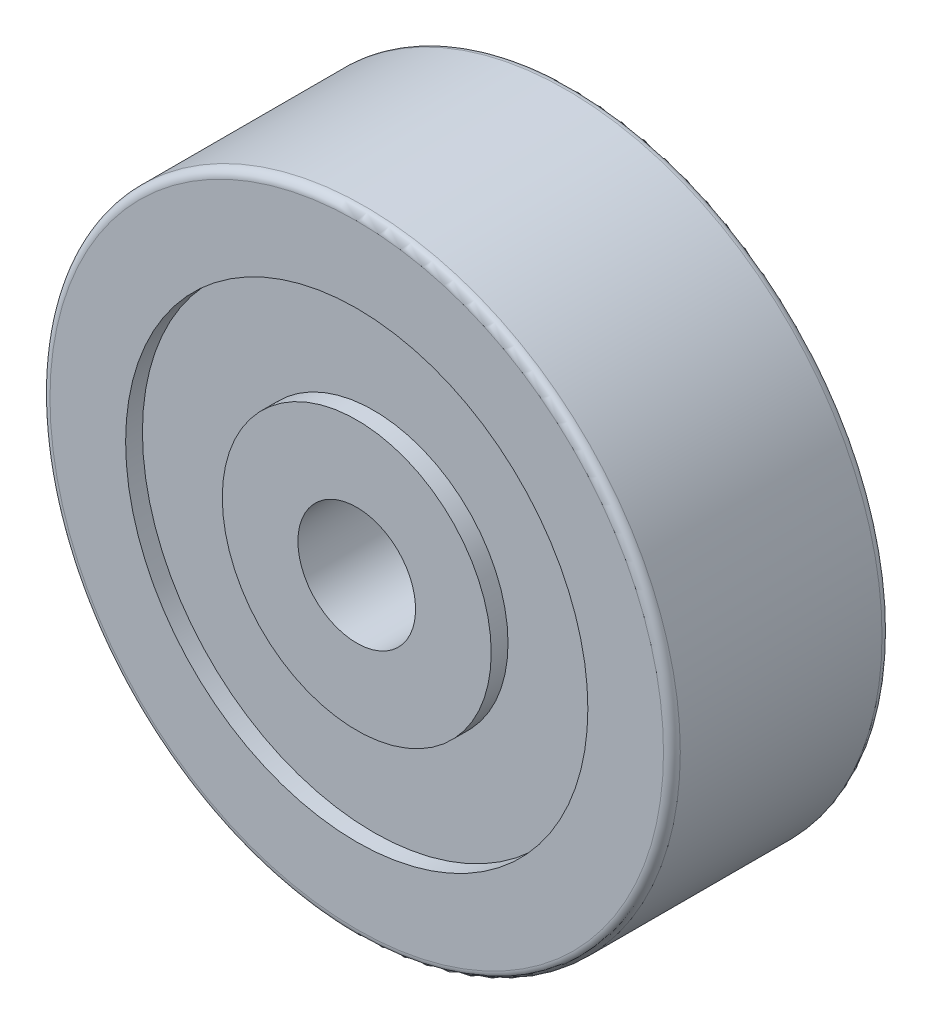
ISO-10303-21;
HEADER;
FILE_DESCRIPTION(('STEP AP214'),'2;1');
FILE_NAME('part.step','',(''),(''),'','','');
FILE_SCHEMA(('AUTOMOTIVE_DESIGN { 1 0 10303 214 1 1 1 1 }'));
ENDSEC;
DATA;
#1=APPLICATION_CONTEXT('core data for automotive mechanical design processes');
#2=APPLICATION_PROTOCOL_DEFINITION('international standard','automotive_design',2000,#1);
#3=PRODUCT_CONTEXT('',#1,'mechanical');
#4=PRODUCT('Part','Part','',(#3));
#5=PRODUCT_RELATED_PRODUCT_CATEGORY('part','',(#4));
#6=PRODUCT_DEFINITION_FORMATION('','',#4);
#7=PRODUCT_DEFINITION_CONTEXT('part definition',#1,'design');
#8=PRODUCT_DEFINITION('design','',#6,#7);
#9=PRODUCT_DEFINITION_SHAPE('','',#8);
#10=(LENGTH_UNIT() NAMED_UNIT(*) SI_UNIT(.MILLI.,.METRE.));
#11=(NAMED_UNIT(*) PLANE_ANGLE_UNIT() SI_UNIT($,.RADIAN.));
#12=(NAMED_UNIT(*) SI_UNIT($,.STERADIAN.) SOLID_ANGLE_UNIT());
#13=UNCERTAINTY_MEASURE_WITH_UNIT(LENGTH_MEASURE(1.E-05),#10,'distance_accuracy_value','');
#14=(GEOMETRIC_REPRESENTATION_CONTEXT(3) GLOBAL_UNCERTAINTY_ASSIGNED_CONTEXT((#13)) GLOBAL_UNIT_ASSIGNED_CONTEXT((#10,
#11,#12)) REPRESENTATION_CONTEXT('',''));
#15=CARTESIAN_POINT('',(0.,0.,0.));
#16=DIRECTION('',(0.,0.,1.));
#17=DIRECTION('',(1.,0.,0.));
#18=AXIS2_PLACEMENT_3D('',#15,#16,#17);
#19=CARTESIAN_POINT('',(0.,0.,-13.));
#20=DIRECTION('',(0.,0.,1.));
#21=DIRECTION('',(1.,0.,0.));
#22=AXIS2_PLACEMENT_3D('',#19,#20,#21);
#23=CYLINDRICAL_SURFACE('',#22,37.5);
#24=CARTESIAN_POINT('',(0.,0.,12.));
#25=DIRECTION('',(0.,0.,1.));
#26=DIRECTION('',(1.,0.,0.));
#27=AXIS2_PLACEMENT_3D('',#24,#25,#26);
#28=CIRCLE('',#27,37.5);
#29=CARTESIAN_POINT('',(37.5,0.,12.));
#30=VERTEX_POINT('',#29);
#31=EDGE_CURVE('E10',#30,#30,#28,.F.);
#32=ORIENTED_EDGE('',*,*,#31,.T.);
#33=EDGE_LOOP('',(#32));
#34=FACE_BOUND('',#33,.T.);
#35=CARTESIAN_POINT('',(0.,0.,-12.));
#36=DIRECTION('',(0.,0.,1.));
#37=DIRECTION('',(1.,0.,0.));
#38=AXIS2_PLACEMENT_3D('',#35,#36,#37);
#39=CIRCLE('',#38,37.5);
#40=CARTESIAN_POINT('',(37.5,0.,-12.));
#41=VERTEX_POINT('',#40);
#42=EDGE_CURVE('E47',#41,#41,#39,.T.);
#43=ORIENTED_EDGE('',*,*,#42,.T.);
#44=EDGE_LOOP('',(#43));
#45=FACE_BOUND('',#44,.T.);
#46=ADVANCED_FACE('F39',(#34,#45),#23,.T.);
#47=CARTESIAN_POINT('',(0.,0.,-13.));
#48=DIRECTION('',(0.,0.,1.));
#49=DIRECTION('',(1.,0.,0.));
#50=AXIS2_PLACEMENT_3D('',#47,#48,#49);
#51=PLANE('',#50);
#52=CARTESIAN_POINT('',(0.,0.,-13.));
#53=DIRECTION('',(0.,0.,1.));
#54=DIRECTION('',(1.,0.,0.));
#55=AXIS2_PLACEMENT_3D('',#52,#53,#54);
#56=CIRCLE('',#55,28.5);
#57=CARTESIAN_POINT('',(28.5,0.,-13.));
#58=VERTEX_POINT('',#57);
#59=EDGE_CURVE('E57',#58,#58,#56,.T.);
#60=ORIENTED_EDGE('',*,*,#59,.T.);
#61=EDGE_LOOP('',(#60));
#62=FACE_BOUND('',#61,.T.);
#63=CARTESIAN_POINT('',(0.,0.,-13.));
#64=DIRECTION('',(0.,0.,1.));
#65=DIRECTION('',(1.,0.,0.));
#66=AXIS2_PLACEMENT_3D('',#63,#64,#65);
#67=CIRCLE('',#66,36.5);
#68=CARTESIAN_POINT('',(36.5,0.,-13.));
#69=VERTEX_POINT('',#68);
#70=EDGE_CURVE('E63',#69,#69,#67,.F.);
#71=ORIENTED_EDGE('',*,*,#70,.T.);
#72=EDGE_LOOP('',(#71));
#73=FACE_BOUND('',#72,.T.);
#74=ADVANCED_FACE('F138',(#62,#73),#51,.F.);
#75=CARTESIAN_POINT('',(0.,0.,13.));
#76=DIRECTION('',(0.,0.,1.));
#77=DIRECTION('',(1.,0.,0.));
#78=AXIS2_PLACEMENT_3D('',#75,#76,#77);
#79=PLANE('',#78);
#80=CARTESIAN_POINT('',(0.,0.,13.));
#81=DIRECTION('',(0.,0.,1.));
#82=DIRECTION('',(1.,0.,0.));
#83=AXIS2_PLACEMENT_3D('',#80,#81,#82);
#84=CIRCLE('',#83,36.5);
#85=CARTESIAN_POINT('',(36.5,0.,13.));
#86=VERTEX_POINT('',#85);
#87=EDGE_CURVE('E52',#86,#86,#84,.T.);
#88=ORIENTED_EDGE('',*,*,#87,.T.);
#89=EDGE_LOOP('',(#88));
#90=FACE_BOUND('',#89,.T.);
#91=CARTESIAN_POINT('',(0.,0.,13.));
#92=DIRECTION('',(0.,0.,-1.));
#93=DIRECTION('',(-1.,0.,0.));
#94=AXIS2_PLACEMENT_3D('',#91,#92,#93);
#95=CIRCLE('',#94,27.5);
#96=CARTESIAN_POINT('',(-27.5,0.,13.));
#97=VERTEX_POINT('',#96);
#98=EDGE_CURVE('E88',#97,#97,#95,.T.);
#99=ORIENTED_EDGE('',*,*,#98,.T.);
#100=EDGE_LOOP('',(#99));
#101=FACE_BOUND('',#100,.T.);
#102=ADVANCED_FACE('F143',(#90,#101),#79,.T.);
#103=CARTESIAN_POINT('',(0.,0.,-11.));
#104=DIRECTION('',(0.,0.,-1.));
#105=DIRECTION('',(-1.,0.,0.));
#106=AXIS2_PLACEMENT_3D('',#103,#104,#105);
#107=CYLINDRICAL_SURFACE('',#106,27.5);
#108=CARTESIAN_POINT('',(0.,0.,-12.));
#109=DIRECTION('',(0.,0.,1.));
#110=DIRECTION('',(1.,0.,0.));
#111=AXIS2_PLACEMENT_3D('',#108,#109,#110);
#112=CIRCLE('',#111,27.5);
#113=CARTESIAN_POINT('',(27.5,0.,-12.));
#114=VERTEX_POINT('',#113);
#115=EDGE_CURVE('E67',#114,#114,#112,.F.);
#116=ORIENTED_EDGE('',*,*,#115,.T.);
#117=EDGE_LOOP('',(#116));
#118=FACE_BOUND('',#117,.T.);
#119=CARTESIAN_POINT('',(0.,0.,-11.));
#120=DIRECTION('',(0.,0.,-1.));
#121=DIRECTION('',(-1.,0.,0.));
#122=AXIS2_PLACEMENT_3D('',#119,#120,#121);
#123=CIRCLE('',#122,27.5);
#124=CARTESIAN_POINT('',(-27.5,0.,-11.));
#125=VERTEX_POINT('',#124);
#126=EDGE_CURVE('E83',#125,#125,#123,.T.);
#127=ORIENTED_EDGE('',*,*,#126,.F.);
#128=EDGE_LOOP('',(#127));
#129=FACE_BOUND('',#128,.T.);
#130=ADVANCED_FACE('F166',(#118,#129),#107,.F.);
#131=CARTESIAN_POINT('',(0.,0.,-11.));
#132=DIRECTION('',(0.,0.,-1.));
#133=DIRECTION('',(-1.,0.,0.));
#134=AXIS2_PLACEMENT_3D('',#131,#132,#133);
#135=PLANE('',#134);
#136=CARTESIAN_POINT('',(0.,0.,-11.));
#137=DIRECTION('',(0.,0.,-1.));
#138=DIRECTION('',(-1.,0.,0.));
#139=AXIS2_PLACEMENT_3D('',#136,#137,#138);
#140=CIRCLE('',#139,16.);
#141=CARTESIAN_POINT('',(-16.,0.,-11.));
#142=VERTEX_POINT('',#141);
#143=EDGE_CURVE('E92',#142,#142,#140,.T.);
#144=ORIENTED_EDGE('',*,*,#143,.F.);
#145=EDGE_LOOP('',(#144));
#146=FACE_BOUND('',#145,.T.);
#147=ORIENTED_EDGE('',*,*,#126,.T.);
#148=EDGE_LOOP('',(#147));
#149=FACE_BOUND('',#148,.T.);
#150=ADVANCED_FACE('F171',(#146,#149),#135,.T.);
#151=CARTESIAN_POINT('',(0.,0.,11.));
#152=DIRECTION('',(0.,0.,1.));
#153=DIRECTION('',(1.,0.,0.));
#154=AXIS2_PLACEMENT_3D('',#151,#152,#153);
#155=CYLINDRICAL_SURFACE('',#154,27.5);
#156=CARTESIAN_POINT('',(0.,0.,11.));
#157=DIRECTION('',(0.,0.,-1.));
#158=DIRECTION('',(-1.,0.,0.));
#159=AXIS2_PLACEMENT_3D('',#156,#157,#158);
#160=CIRCLE('',#159,27.5);
#161=CARTESIAN_POINT('',(-27.5,0.,11.));
#162=VERTEX_POINT('',#161);
#163=EDGE_CURVE('E87',#162,#162,#160,.T.);
#164=ORIENTED_EDGE('',*,*,#163,.T.);
#165=EDGE_LOOP('',(#164));
#166=FACE_BOUND('',#165,.T.);
#167=ORIENTED_EDGE('',*,*,#98,.F.);
#168=EDGE_LOOP('',(#167));
#169=FACE_BOUND('',#168,.T.);
#170=ADVANCED_FACE('F169',(#166,#169),#155,.F.);
#171=CARTESIAN_POINT('',(0.,0.,11.));
#172=DIRECTION('',(0.,0.,1.));
#173=DIRECTION('',(-1.,0.,0.));
#174=AXIS2_PLACEMENT_3D('',#171,#172,#173);
#175=PLANE('',#174);
#176=CARTESIAN_POINT('',(0.,0.,11.));
#177=DIRECTION('',(0.,0.,1.));
#178=DIRECTION('',(1.,0.,0.));
#179=AXIS2_PLACEMENT_3D('',#176,#177,#178);
#180=CIRCLE('',#179,16.);
#181=CARTESIAN_POINT('',(16.,0.,11.));
#182=VERTEX_POINT('',#181);
#183=EDGE_CURVE('E79',#182,#182,#180,.T.);
#184=ORIENTED_EDGE('',*,*,#183,.F.);
#185=EDGE_LOOP('',(#184));
#186=FACE_BOUND('',#185,.T.);
#187=ORIENTED_EDGE('',*,*,#163,.F.);
#188=EDGE_LOOP('',(#187));
#189=FACE_BOUND('',#188,.T.);
#190=ADVANCED_FACE('F134',(#186,#189),#175,.T.);
#191=CARTESIAN_POINT('',(0.,0.,-13.));
#192=DIRECTION('',(0.,0.,1.));
#193=DIRECTION('',(1.,0.,0.));
#194=AXIS2_PLACEMENT_3D('',#191,#192,#193);
#195=CYLINDRICAL_SURFACE('',#194,16.);
#196=CARTESIAN_POINT('',(0.,0.,-12.));
#197=DIRECTION('',(0.,0.,-1.));
#198=DIRECTION('',(-1.,0.,0.));
#199=AXIS2_PLACEMENT_3D('',#196,#197,#198);
#200=CIRCLE('',#199,16.);
#201=CARTESIAN_POINT('',(-16.,0.,-12.));
#202=VERTEX_POINT('',#201);
#203=EDGE_CURVE('E71',#202,#202,#200,.F.);
#204=ORIENTED_EDGE('',*,*,#203,.T.);
#205=EDGE_LOOP('',(#204));
#206=FACE_BOUND('',#205,.T.);
#207=ORIENTED_EDGE('',*,*,#143,.T.);
#208=EDGE_LOOP('',(#207));
#209=FACE_BOUND('',#208,.T.);
#210=ADVANCED_FACE('F125',(#206,#209),#195,.T.);
#211=CARTESIAN_POINT('',(0.,0.,-13.));
#212=DIRECTION('',(0.,0.,-1.));
#213=DIRECTION('',(-1.,0.,0.));
#214=AXIS2_PLACEMENT_3D('',#211,#212,#213);
#215=PLANE('',#214);
#216=CARTESIAN_POINT('',(0.,0.,-13.));
#217=DIRECTION('',(0.,0.,-1.));
#218=DIRECTION('',(-1.,0.,0.));
#219=AXIS2_PLACEMENT_3D('',#216,#217,#218);
#220=CIRCLE('',#219,15.);
#221=CARTESIAN_POINT('',(-15.,0.,-13.));
#222=VERTEX_POINT('',#221);
#223=EDGE_CURVE('E75',#222,#222,#220,.T.);
#224=ORIENTED_EDGE('',*,*,#223,.T.);
#225=EDGE_LOOP('',(#224));
#226=FACE_BOUND('',#225,.T.);
#227=CARTESIAN_POINT('',(0.,0.,-13.));
#228=DIRECTION('',(0.,0.,-1.));
#229=DIRECTION('',(-1.,0.,0.));
#230=AXIS2_PLACEMENT_3D('',#227,#228,#229);
#231=CIRCLE('',#230,7.);
#232=CARTESIAN_POINT('',(-7.,0.,-13.));
#233=VERTEX_POINT('',#232);
#234=EDGE_CURVE('E104',#233,#233,#231,.T.);
#235=ORIENTED_EDGE('',*,*,#234,.F.);
#236=EDGE_LOOP('',(#235));
#237=FACE_BOUND('',#236,.T.);
#238=ADVANCED_FACE('F122',(#226,#237),#215,.T.);
#239=CARTESIAN_POINT('',(0.,0.,13.));
#240=DIRECTION('',(0.,0.,-1.));
#241=DIRECTION('',(-1.,0.,0.));
#242=AXIS2_PLACEMENT_3D('',#239,#240,#241);
#243=CYLINDRICAL_SURFACE('',#242,16.);
#244=CARTESIAN_POINT('',(0.,0.,13.));
#245=DIRECTION('',(0.,0.,-1.));
#246=DIRECTION('',(-1.,0.,0.));
#247=AXIS2_PLACEMENT_3D('',#244,#245,#246);
#248=CIRCLE('',#247,16.);
#249=CARTESIAN_POINT('',(-16.,0.,13.));
#250=VERTEX_POINT('',#249);
#251=EDGE_CURVE('E99',#250,#250,#248,.T.);
#252=ORIENTED_EDGE('',*,*,#251,.T.);
#253=EDGE_LOOP('',(#252));
#254=FACE_BOUND('',#253,.T.);
#255=ORIENTED_EDGE('',*,*,#183,.T.);
#256=EDGE_LOOP('',(#255));
#257=FACE_BOUND('',#256,.T.);
#258=ADVANCED_FACE('F124',(#254,#257),#243,.T.);
#259=CARTESIAN_POINT('',(0.,0.,13.));
#260=DIRECTION('',(0.,0.,1.));
#261=DIRECTION('',(-1.,0.,0.));
#262=AXIS2_PLACEMENT_3D('',#259,#260,#261);
#263=PLANE('',#262);
#264=CARTESIAN_POINT('',(0.,0.,13.));
#265=DIRECTION('',(0.,0.,-1.));
#266=DIRECTION('',(-1.,0.,0.));
#267=AXIS2_PLACEMENT_3D('',#264,#265,#266);
#268=CIRCLE('',#267,7.);
#269=CARTESIAN_POINT('',(-7.,0.,13.));
#270=VERTEX_POINT('',#269);
#271=EDGE_CURVE('E103',#270,#270,#268,.T.);
#272=ORIENTED_EDGE('',*,*,#271,.T.);
#273=EDGE_LOOP('',(#272));
#274=FACE_BOUND('',#273,.T.);
#275=ORIENTED_EDGE('',*,*,#251,.F.);
#276=EDGE_LOOP('',(#275));
#277=FACE_BOUND('',#276,.T.);
#278=ADVANCED_FACE('F112',(#274,#277),#263,.T.);
#279=CARTESIAN_POINT('',(0.,0.,13.));
#280=DIRECTION('',(0.,0.,-1.));
#281=DIRECTION('',(-1.,0.,0.));
#282=AXIS2_PLACEMENT_3D('',#279,#280,#281);
#283=CYLINDRICAL_SURFACE('',#282,7.);
#284=ORIENTED_EDGE('',*,*,#271,.F.);
#285=EDGE_LOOP('',(#284));
#286=FACE_BOUND('',#285,.T.);
#287=ORIENTED_EDGE('',*,*,#234,.T.);
#288=EDGE_LOOP('',(#287));
#289=FACE_BOUND('',#288,.T.);
#290=ADVANCED_FACE('F115',(#286,#289),#283,.F.);
#291=CARTESIAN_POINT('',(0.,0.,-12.));
#292=DIRECTION('',(0.,0.,-1.));
#293=DIRECTION('',(-1.,0.,0.));
#294=AXIS2_PLACEMENT_3D('',#291,#292,#293);
#295=TOROIDAL_SURFACE('',#294,15.,1.);
#296=ORIENTED_EDGE('',*,*,#203,.F.);
#297=EDGE_LOOP('',(#296));
#298=FACE_BOUND('',#297,.T.);
#299=ORIENTED_EDGE('',*,*,#223,.F.);
#300=EDGE_LOOP('',(#299));
#301=FACE_BOUND('',#300,.T.);
#302=ADVANCED_FACE('F118',(#298,#301),#295,.T.);
#303=CARTESIAN_POINT('',(0.,0.,-12.));
#304=DIRECTION('',(0.,0.,1.));
#305=DIRECTION('',(1.,0.,0.));
#306=AXIS2_PLACEMENT_3D('',#303,#304,#305);
#307=TOROIDAL_SURFACE('',#306,28.5,1.);
#308=ORIENTED_EDGE('',*,*,#59,.F.);
#309=EDGE_LOOP('',(#308));
#310=FACE_BOUND('',#309,.T.);
#311=ORIENTED_EDGE('',*,*,#115,.F.);
#312=EDGE_LOOP('',(#311));
#313=FACE_BOUND('',#312,.T.);
#314=ADVANCED_FACE('F150',(#310,#313),#307,.T.);
#315=CARTESIAN_POINT('',(0.,0.,12.));
#316=DIRECTION('',(0.,0.,1.));
#317=DIRECTION('',(1.,0.,0.));
#318=AXIS2_PLACEMENT_3D('',#315,#316,#317);
#319=TOROIDAL_SURFACE('',#318,36.5,1.);
#320=ORIENTED_EDGE('',*,*,#31,.F.);
#321=EDGE_LOOP('',(#320));
#322=FACE_BOUND('',#321,.T.);
#323=ORIENTED_EDGE('',*,*,#87,.F.);
#324=EDGE_LOOP('',(#323));
#325=FACE_BOUND('',#324,.T.);
#326=ADVANCED_FACE('F153',(#322,#325),#319,.T.);
#327=CARTESIAN_POINT('',(0.,0.,-12.));
#328=DIRECTION('',(0.,0.,1.));
#329=DIRECTION('',(1.,0.,0.));
#330=AXIS2_PLACEMENT_3D('',#327,#328,#329);
#331=TOROIDAL_SURFACE('',#330,36.5,1.);
#332=ORIENTED_EDGE('',*,*,#70,.F.);
#333=EDGE_LOOP('',(#332));
#334=FACE_BOUND('',#333,.T.);
#335=ORIENTED_EDGE('',*,*,#42,.F.);
#336=EDGE_LOOP('',(#335));
#337=FACE_BOUND('',#336,.T.);
#338=ADVANCED_FACE('F41',(#334,#337),#331,.T.);
#339=CLOSED_SHELL('',(#46,#74,#102,#130,#150,#170,#190,#210,#238,#258,#278,#290,#302,#314,#326,#338));
#340=MANIFOLD_SOLID_BREP('B2',#339);
#341=ADVANCED_BREP_SHAPE_REPRESENTATION('',(#18,#340),#14);
#342=SHAPE_DEFINITION_REPRESENTATION(#9,#341);
ENDSEC;
END-ISO-10303-21;
